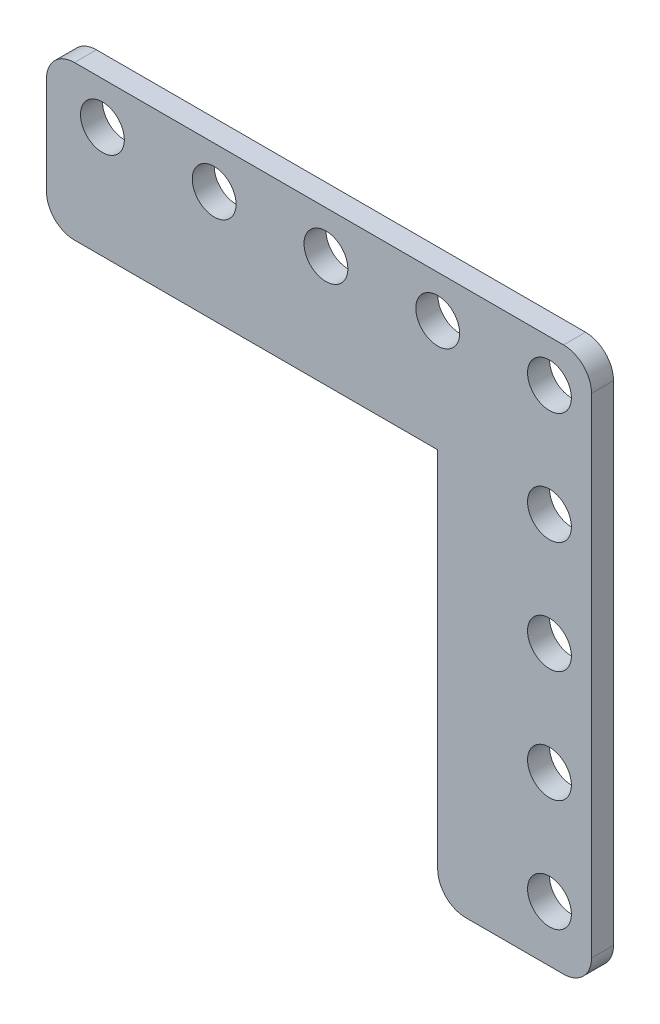
ISO-10303-21;
HEADER;
FILE_DESCRIPTION(('STEP AP214'),'2;1');
FILE_NAME('part.step','',(''),(''),'','','');
FILE_SCHEMA(('AUTOMOTIVE_DESIGN { 1 0 10303 214 1 1 1 1 }'));
ENDSEC;
DATA;
#1=APPLICATION_CONTEXT('core data for automotive mechanical design processes');
#2=APPLICATION_PROTOCOL_DEFINITION('international standard','automotive_design',2000,#1);
#3=PRODUCT_CONTEXT('',#1,'mechanical');
#4=PRODUCT('Part','Part','',(#3));
#5=PRODUCT_RELATED_PRODUCT_CATEGORY('part','',(#4));
#6=PRODUCT_DEFINITION_FORMATION('','',#4);
#7=PRODUCT_DEFINITION_CONTEXT('part definition',#1,'design');
#8=PRODUCT_DEFINITION('design','',#6,#7);
#9=PRODUCT_DEFINITION_SHAPE('','',#8);
#10=(LENGTH_UNIT() NAMED_UNIT(*) SI_UNIT(.MILLI.,.METRE.));
#11=(NAMED_UNIT(*) PLANE_ANGLE_UNIT() SI_UNIT($,.RADIAN.));
#12=(NAMED_UNIT(*) SI_UNIT($,.STERADIAN.) SOLID_ANGLE_UNIT());
#13=UNCERTAINTY_MEASURE_WITH_UNIT(LENGTH_MEASURE(1.E-05),#10,'distance_accuracy_value','');
#14=(GEOMETRIC_REPRESENTATION_CONTEXT(3) GLOBAL_UNCERTAINTY_ASSIGNED_CONTEXT((#13)) GLOBAL_UNIT_ASSIGNED_CONTEXT((#10,
#11,#12)) REPRESENTATION_CONTEXT('',''));
#15=CARTESIAN_POINT('',(0.,0.,0.));
#16=DIRECTION('',(0.,0.,1.));
#17=DIRECTION('',(1.,0.,0.));
#18=AXIS2_PLACEMENT_3D('',#15,#16,#17);
#19=CARTESIAN_POINT('',(-13.4873999999968,875.512599999967,2.50000000000015));
#20=DIRECTION('',(0.,0.,1.));
#21=DIRECTION('',(1.,0.,0.));
#22=AXIS2_PLACEMENT_3D('',#19,#20,#21);
#23=PLANE('',#22);
#24=CARTESIAN_POINT('',(-38.0999999999977,901.699999999967,2.50000000000015));
#25=DIRECTION('',(0.,0.,-1.));
#26=DIRECTION('',(1.,0.,0.));
#27=AXIS2_PLACEMENT_3D('',#24,#25,#26);
#28=CIRCLE('',#27,2.4892);
#29=CARTESIAN_POINT('',(-40.5891999999977,901.699999999967,2.50000000000015));
#30=VERTEX_POINT('',#29);
#31=EDGE_CURVE('E180',#30,#30,#28,.T.);
#32=ORIENTED_EDGE('',*,*,#31,.T.);
#33=EDGE_LOOP('',(#32));
#34=FACE_BOUND('',#33,.T.);
#35=CARTESIAN_POINT('',(12.7000000000032,901.699999999967,2.50000000000015));
#36=DIRECTION('',(0.,0.,-1.));
#37=DIRECTION('',(1.,0.,0.));
#38=AXIS2_PLACEMENT_3D('',#35,#36,#37);
#39=CIRCLE('',#38,2.4892);
#40=CARTESIAN_POINT('',(10.2108000000032,901.699999999967,2.50000000000015));
#41=VERTEX_POINT('',#40);
#42=EDGE_CURVE('E220',#41,#41,#39,.T.);
#43=ORIENTED_EDGE('',*,*,#42,.T.);
#44=EDGE_LOOP('',(#43));
#45=FACE_BOUND('',#44,.T.);
#46=CARTESIAN_POINT('',(12.700000000003,850.89999999997,2.50000000000015));
#47=DIRECTION('',(0.,0.,-1.));
#48=DIRECTION('',(1.,0.,0.));
#49=AXIS2_PLACEMENT_3D('',#46,#47,#48);
#50=CIRCLE('',#49,2.4892);
#51=CARTESIAN_POINT('',(10.210800000003,850.89999999997,2.50000000000015));
#52=VERTEX_POINT('',#51);
#53=EDGE_CURVE('E208',#52,#52,#50,.T.);
#54=ORIENTED_EDGE('',*,*,#53,.T.);
#55=EDGE_LOOP('',(#54));
#56=FACE_BOUND('',#55,.T.);
#57=CARTESIAN_POINT('',(12.7000000000032,888.999999999967,2.50000000000015));
#58=DIRECTION('',(0.,0.,-1.));
#59=DIRECTION('',(1.,0.,0.));
#60=AXIS2_PLACEMENT_3D('',#57,#58,#59);
#61=CIRCLE('',#60,2.4892);
#62=CARTESIAN_POINT('',(10.2108000000032,888.999999999967,2.50000000000015));
#63=VERTEX_POINT('',#62);
#64=EDGE_CURVE('E148',#63,#63,#61,.T.);
#65=ORIENTED_EDGE('',*,*,#64,.T.);
#66=EDGE_LOOP('',(#65));
#67=FACE_BOUND('',#66,.T.);
#68=CARTESIAN_POINT('',(-25.3999999999976,901.699999999967,2.50000000000015));
#69=DIRECTION('',(0.,0.,-1.));
#70=DIRECTION('',(1.,0.,0.));
#71=AXIS2_PLACEMENT_3D('',#68,#69,#70);
#72=CIRCLE('',#71,2.4892);
#73=CARTESIAN_POINT('',(-27.8891999999977,901.699999999967,2.50000000000015));
#74=VERTEX_POINT('',#73);
#75=EDGE_CURVE('E184',#74,#74,#72,.T.);
#76=ORIENTED_EDGE('',*,*,#75,.T.);
#77=EDGE_LOOP('',(#76));
#78=FACE_BOUND('',#77,.T.);
#79=CARTESIAN_POINT('',(3.29514193708748E-12,901.699999999967,2.50000000000015));
#80=DIRECTION('',(0.,0.,-1.));
#81=DIRECTION('',(1.,0.,0.));
#82=AXIS2_PLACEMENT_3D('',#79,#80,#81);
#83=CIRCLE('',#82,2.4892);
#84=CARTESIAN_POINT('',(-2.4891999999967,901.699999999967,2.50000000000015));
#85=VERTEX_POINT('',#84);
#86=EDGE_CURVE('E137',#85,#85,#83,.T.);
#87=ORIENTED_EDGE('',*,*,#86,.T.);
#88=EDGE_LOOP('',(#87));
#89=FACE_BOUND('',#88,.T.);
#90=CARTESIAN_POINT('',(12.7000000000031,863.59999999997,2.50000000000015));
#91=DIRECTION('',(0.,0.,-1.));
#92=DIRECTION('',(1.,0.,0.));
#93=AXIS2_PLACEMENT_3D('',#90,#91,#92);
#94=CIRCLE('',#93,2.4892);
#95=CARTESIAN_POINT('',(10.2108000000031,863.59999999997,2.50000000000015));
#96=VERTEX_POINT('',#95);
#97=EDGE_CURVE('E168',#96,#96,#94,.T.);
#98=ORIENTED_EDGE('',*,*,#97,.T.);
#99=EDGE_LOOP('',(#98));
#100=FACE_BOUND('',#99,.T.);
#101=CARTESIAN_POINT('',(12.7000000000031,876.299999999969,2.50000000000015));
#102=DIRECTION('',(0.,0.,-1.));
#103=DIRECTION('',(1.,0.,0.));
#104=AXIS2_PLACEMENT_3D('',#101,#102,#103);
#105=CIRCLE('',#104,2.4892);
#106=CARTESIAN_POINT('',(10.2108000000031,876.299999999969,2.50000000000015));
#107=VERTEX_POINT('',#106);
#108=EDGE_CURVE('E143',#107,#107,#105,.T.);
#109=ORIENTED_EDGE('',*,*,#108,.T.);
#110=EDGE_LOOP('',(#109));
#111=FACE_BOUND('',#110,.T.);
#112=CARTESIAN_POINT('',(-12.699999999997,901.699999999967,2.50000000000015));
#113=DIRECTION('',(0.,0.,-1.));
#114=DIRECTION('',(1.,0.,0.));
#115=AXIS2_PLACEMENT_3D('',#112,#113,#114);
#116=CIRCLE('',#115,2.4892);
#117=CARTESIAN_POINT('',(-15.189199999997,901.699999999967,2.50000000000015));
#118=VERTEX_POINT('',#117);
#119=EDGE_CURVE('E133',#118,#118,#116,.T.);
#120=ORIENTED_EDGE('',*,*,#119,.T.);
#121=EDGE_LOOP('',(#120));
#122=FACE_BOUND('',#121,.T.);
#123=CARTESIAN_POINT('',(14.3002000000032,847.724999999967,2.50000000000015));
#124=DIRECTION('',(0.,0.,-1.));
#125=DIRECTION('',(0.707106781186552,-0.707106781186543,0.));
#126=AXIS2_PLACEMENT_3D('',#123,#124,#125);
#127=CIRCLE('',#126,3.175);
#128=CARTESIAN_POINT('',(17.4752000000032,847.724999999967,2.50000000000015));
#129=VERTEX_POINT('',#128);
#130=CARTESIAN_POINT('',(14.3002000000032,844.549999999967,2.50000000000015));
#131=VERTEX_POINT('',#130);
#132=EDGE_CURVE('E232',#129,#131,#127,.T.);
#133=ORIENTED_EDGE('',*,*,#132,.F.);
#134=DIRECTION('',(0.,1.,0.));
#135=VECTOR('',#134,1.);
#136=CARTESIAN_POINT('',(17.4752000000032,844.549999999967,2.50000000000015));
#137=LINE('',#136,#135);
#138=CARTESIAN_POINT('',(17.4752000000032,903.300199999967,2.50000000000015));
#139=VERTEX_POINT('',#138);
#140=EDGE_CURVE('E84',#129,#139,#137,.T.);
#141=ORIENTED_EDGE('',*,*,#140,.T.);
#142=CARTESIAN_POINT('',(14.3002000000032,903.300199999967,2.50000000000015));
#143=DIRECTION('',(0.,0.,-1.));
#144=DIRECTION('',(0.707106781186552,0.707106781186543,0.));
#145=AXIS2_PLACEMENT_3D('',#142,#143,#144);
#146=CIRCLE('',#145,3.175);
#147=CARTESIAN_POINT('',(14.3002000000032,906.475199999967,2.50000000000015));
#148=VERTEX_POINT('',#147);
#149=EDGE_CURVE('E90',#148,#139,#146,.T.);
#150=ORIENTED_EDGE('',*,*,#149,.F.);
#151=DIRECTION('',(-1.,0.,0.));
#152=VECTOR('',#151,1.);
#153=CARTESIAN_POINT('',(17.4752000000032,906.475199999967,2.50000000000015));
#154=LINE('',#153,#152);
#155=CARTESIAN_POINT('',(-41.2749999999967,906.475199999967,2.50000000000015));
#156=VERTEX_POINT('',#155);
#157=EDGE_CURVE('E71',#148,#156,#154,.T.);
#158=ORIENTED_EDGE('',*,*,#157,.T.);
#159=CARTESIAN_POINT('',(-41.2749999999967,903.300199999967,2.50000000000015));
#160=DIRECTION('',(0.,0.,-1.));
#161=DIRECTION('',(-0.707106781186552,0.707106781186543,0.));
#162=AXIS2_PLACEMENT_3D('',#159,#160,#161);
#163=CIRCLE('',#162,3.175);
#164=CARTESIAN_POINT('',(-44.4499999999967,903.300199999967,2.50000000000015));
#165=VERTEX_POINT('',#164);
#166=EDGE_CURVE('E107',#165,#156,#163,.T.);
#167=ORIENTED_EDGE('',*,*,#166,.F.);
#168=DIRECTION('',(0.,-1.,0.));
#169=VECTOR('',#168,1.);
#170=CARTESIAN_POINT('',(-44.4499999999967,906.475199999967,2.50000000000015));
#171=LINE('',#170,#169);
#172=CARTESIAN_POINT('',(-44.4499999999967,892.174999999967,2.50000000000015));
#173=VERTEX_POINT('',#172);
#174=EDGE_CURVE('E305',#165,#173,#171,.T.);
#175=ORIENTED_EDGE('',*,*,#174,.T.);
#176=CARTESIAN_POINT('',(-41.2749999999967,892.174999999967,2.50000000000015));
#177=DIRECTION('',(0.,0.,-1.));
#178=DIRECTION('',(-0.707106781186552,-0.707106781186543,0.));
#179=AXIS2_PLACEMENT_3D('',#176,#177,#178);
#180=CIRCLE('',#179,3.175);
#181=CARTESIAN_POINT('',(-41.2749999999967,888.999999999967,2.50000000000015));
#182=VERTEX_POINT('',#181);
#183=EDGE_CURVE('E243',#182,#173,#180,.T.);
#184=ORIENTED_EDGE('',*,*,#183,.F.);
#185=DIRECTION('',(1.,0.,0.));
#186=VECTOR('',#185,1.);
#187=CARTESIAN_POINT('',(-44.4499999999967,888.999999999967,2.50000000000015));
#188=LINE('',#187,#186);
#189=CARTESIAN_POINT('',(3.22408766351145E-12,888.999999999967,2.50000000000015));
#190=VERTEX_POINT('',#189);
#191=EDGE_CURVE('E11',#182,#190,#188,.T.);
#192=ORIENTED_EDGE('',*,*,#191,.T.);
#193=DIRECTION('',(0.,-1.,0.));
#194=VECTOR('',#193,1.);
#195=CARTESIAN_POINT('',(3.22408766351145E-12,888.999999999967,2.50000000000015));
#196=LINE('',#195,#194);
#197=CARTESIAN_POINT('',(3.10656262619042E-12,847.724999999967,2.50000000000015));
#198=VERTEX_POINT('',#197);
#199=EDGE_CURVE('E83',#190,#198,#196,.T.);
#200=ORIENTED_EDGE('',*,*,#199,.T.);
#201=CARTESIAN_POINT('',(3.1750000000031,847.724999999967,2.50000000000015));
#202=DIRECTION('',(0.,0.,-1.));
#203=DIRECTION('',(-0.707106781186553,-0.707106781186542,0.));
#204=AXIS2_PLACEMENT_3D('',#201,#202,#203);
#205=CIRCLE('',#204,3.175);
#206=CARTESIAN_POINT('',(3.1750000000031,844.549999999967,2.50000000000015));
#207=VERTEX_POINT('',#206);
#208=EDGE_CURVE('E188',#207,#198,#205,.T.);
#209=ORIENTED_EDGE('',*,*,#208,.F.);
#210=DIRECTION('',(1.,0.,0.));
#211=VECTOR('',#210,1.);
#212=CARTESIAN_POINT('',(3.0975222387042E-12,844.549999999967,2.50000000000015));
#213=LINE('',#212,#211);
#214=EDGE_CURVE('E289',#207,#131,#213,.T.);
#215=ORIENTED_EDGE('',*,*,#214,.T.);
#216=EDGE_LOOP('',(#133,#141,#150,#158,#167,#175,#184,#192,#200,#209,#215));
#217=FACE_BOUND('',#216,.T.);
#218=ADVANCED_FACE('F17',(#34,#45,#56,#67,#78,#89,#100,#111,#122,#217),#23,.T.);
#219=CARTESIAN_POINT('',(-44.4499999999967,888.999999999967,1.53287466406063E-13));
#220=DIRECTION('',(0.,-1.,0.));
#221=DIRECTION('',(-1.,0.,0.));
#222=AXIS2_PLACEMENT_3D('',#219,#220,#221);
#223=PLANE('',#222);
#224=DIRECTION('',(0.,0.,1.));
#225=VECTOR('',#224,1.);
#226=CARTESIAN_POINT('',(-41.2749999999967,888.999999999967,1.53397238558369E-13));
#227=LINE('',#226,#225);
#228=CARTESIAN_POINT('',(-41.2749999999967,888.999999999967,1.5328673490841E-13));
#229=VERTEX_POINT('',#228);
#230=EDGE_CURVE('E302',#229,#182,#227,.T.);
#231=ORIENTED_EDGE('',*,*,#230,.F.);
#232=DIRECTION('',(1.,0.,0.));
#233=VECTOR('',#232,1.);
#234=CARTESIAN_POINT('',(-44.4499999999967,888.999999999967,1.53287466406063E-13));
#235=LINE('',#234,#233);
#236=CARTESIAN_POINT('',(3.22408766351145E-12,888.999999999967,1.53277225438917E-13));
#237=VERTEX_POINT('',#236);
#238=EDGE_CURVE('E265',#229,#237,#235,.T.);
#239=ORIENTED_EDGE('',*,*,#238,.T.);
#240=DIRECTION('',(0.,0.,1.));
#241=VECTOR('',#240,1.);
#242=CARTESIAN_POINT('',(3.22408766351145E-12,888.999999999967,1.53277225438917E-13));
#243=LINE('',#242,#241);
#244=EDGE_CURVE('E26',#237,#190,#243,.T.);
#245=ORIENTED_EDGE('',*,*,#244,.T.);
#246=ORIENTED_EDGE('',*,*,#191,.F.);
#247=EDGE_LOOP('',(#231,#239,#245,#246));
#248=FACE_BOUND('',#247,.T.);
#249=ADVANCED_FACE('F415',(#248),#223,.T.);
#250=CARTESIAN_POINT('',(3.22408766351145E-12,888.999999999967,1.53277225438917E-13));
#251=DIRECTION('',(-1.,0.,0.));
#252=DIRECTION('',(0.,0.,1.));
#253=AXIS2_PLACEMENT_3D('',#250,#251,#252);
#254=PLANE('',#253);
#255=DIRECTION('',(0.,0.,-1.));
#256=VECTOR('',#255,1.);
#257=CARTESIAN_POINT('',(3.1064040229012E-12,847.724999999967,1.52998008481745E-13));
#258=LINE('',#257,#256);
#259=CARTESIAN_POINT('',(3.10656262619042E-12,847.724999999967,1.52758679661312E-13));
#260=VERTEX_POINT('',#259);
#261=EDGE_CURVE('E192',#198,#260,#258,.T.);
#262=ORIENTED_EDGE('',*,*,#261,.F.);
#263=ORIENTED_EDGE('',*,*,#199,.F.);
#264=ORIENTED_EDGE('',*,*,#244,.F.);
#265=DIRECTION('',(0.,-1.,0.));
#266=VECTOR('',#265,1.);
#267=CARTESIAN_POINT('',(3.22408766351145E-12,888.999999999967,1.53277225438917E-13));
#268=LINE('',#267,#266);
#269=EDGE_CURVE('E163',#237,#260,#268,.T.);
#270=ORIENTED_EDGE('',*,*,#269,.T.);
#271=EDGE_LOOP('',(#262,#263,#264,#270));
#272=FACE_BOUND('',#271,.T.);
#273=ADVANCED_FACE('F421',(#272),#254,.T.);
#274=CARTESIAN_POINT('',(17.4752000000032,906.475199999967,1.53492743580445E-13));
#275=DIRECTION('',(0.,1.,0.));
#276=DIRECTION('',(1.,0.,0.));
#277=AXIS2_PLACEMENT_3D('',#274,#275,#276);
#278=PLANE('',#277);
#279=DIRECTION('',(0.,0.,-1.));
#280=VECTOR('',#279,1.);
#281=CARTESIAN_POINT('',(-41.2749999999967,906.475199999967,1.5349987714556E-13));
#282=LINE('',#281,#280);
#283=CARTESIAN_POINT('',(-41.2749999999967,906.475199999967,1.53506279213021E-13));
#284=VERTEX_POINT('',#283);
#285=EDGE_CURVE('E79',#156,#284,#282,.T.);
#286=ORIENTED_EDGE('',*,*,#285,.F.);
#287=ORIENTED_EDGE('',*,*,#157,.F.);
#288=DIRECTION('',(0.,0.,1.));
#289=VECTOR('',#288,1.);
#290=CARTESIAN_POINT('',(14.3002000000032,906.475199999967,1.53103754470967E-13));
#291=LINE('',#290,#289);
#292=CARTESIAN_POINT('',(14.3002000000032,906.475199999967,1.53493475078099E-13));
#293=VERTEX_POINT('',#292);
#294=EDGE_CURVE('E76',#293,#148,#291,.T.);
#295=ORIENTED_EDGE('',*,*,#294,.F.);
#296=DIRECTION('',(-1.,0.,0.));
#297=VECTOR('',#296,1.);
#298=CARTESIAN_POINT('',(17.4752000000032,906.475199999967,1.53492743580445E-13));
#299=LINE('',#298,#297);
#300=EDGE_CURVE('E280',#293,#284,#299,.T.);
#301=ORIENTED_EDGE('',*,*,#300,.T.);
#302=EDGE_LOOP('',(#286,#287,#295,#301));
#303=FACE_BOUND('',#302,.T.);
#304=ADVANCED_FACE('F73',(#303),#278,.T.);
#305=CARTESIAN_POINT('',(17.4752000000032,844.549999999967,1.52714765361489E-13));
#306=DIRECTION('',(1.,0.,0.));
#307=DIRECTION('',(0.,1.,0.));
#308=AXIS2_PLACEMENT_3D('',#305,#306,#307);
#309=PLANE('',#308);
#310=DIRECTION('',(0.,0.,1.));
#311=VECTOR('',#310,1.);
#312=CARTESIAN_POINT('',(17.4752000000032,847.724999999967,1.52716778443031E-13));
#313=LINE('',#312,#311);
#314=CARTESIAN_POINT('',(17.4752000000032,847.724999999967,1.52754653498228E-13));
#315=VERTEX_POINT('',#314);
#316=EDGE_CURVE('E255',#315,#129,#313,.T.);
#317=ORIENTED_EDGE('',*,*,#316,.F.);
#318=DIRECTION('',(0.,1.,0.));
#319=VECTOR('',#318,1.);
#320=CARTESIAN_POINT('',(17.4752000000032,844.549999999967,1.52714765361489E-13));
#321=LINE('',#320,#319);
#322=CARTESIAN_POINT('',(17.4752000000032,903.300199999967,1.53452855443706E-13));
#323=VERTEX_POINT('',#322);
#324=EDGE_CURVE('E285',#315,#323,#321,.T.);
#325=ORIENTED_EDGE('',*,*,#324,.T.);
#326=DIRECTION('',(0.,0.,-1.));
#327=VECTOR('',#326,1.);
#328=CARTESIAN_POINT('',(17.4752000000032,903.300199999967,1.53103754470967E-13));
#329=LINE('',#328,#327);
#330=EDGE_CURVE('E95',#139,#323,#329,.T.);
#331=ORIENTED_EDGE('',*,*,#330,.F.);
#332=ORIENTED_EDGE('',*,*,#140,.F.);
#333=EDGE_LOOP('',(#317,#325,#331,#332));
#334=FACE_BOUND('',#333,.T.);
#335=ADVANCED_FACE('F394',(#334),#309,.T.);
#336=CARTESIAN_POINT('',(14.3002000000032,903.300199999967,1.53103754470967E-13));
#337=DIRECTION('',(0.,0.,1.));
#338=DIRECTION('',(0.707106781186552,0.707106781186543,0.));
#339=AXIS2_PLACEMENT_3D('',#336,#337,#338);
#340=CYLINDRICAL_SURFACE('',#339,3.175);
#341=ORIENTED_EDGE('',*,*,#149,.T.);
#342=ORIENTED_EDGE('',*,*,#330,.T.);
#343=CARTESIAN_POINT('',(14.3002000000032,903.300199999967,1.53110888036082E-13));
#344=DIRECTION('',(0.,0.,1.));
#345=DIRECTION('',(0.707106781186552,0.707106781186543,0.));
#346=AXIS2_PLACEMENT_3D('',#343,#344,#345);
#347=CIRCLE('',#346,3.175);
#348=EDGE_CURVE('E92',#323,#293,#347,.T.);
#349=ORIENTED_EDGE('',*,*,#348,.T.);
#350=ORIENTED_EDGE('',*,*,#294,.T.);
#351=EDGE_LOOP('',(#341,#342,#349,#350));
#352=FACE_BOUND('',#351,.T.);
#353=ADVANCED_FACE('F88',(#352),#340,.T.);
#354=CARTESIAN_POINT('',(-41.2749999999967,903.300199999967,1.5349987714556E-13));
#355=DIRECTION('',(0.,0.,1.));
#356=DIRECTION('',(-0.707106781186552,0.707106781186543,0.));
#357=AXIS2_PLACEMENT_3D('',#354,#355,#356);
#358=CYLINDRICAL_SURFACE('',#357,3.175);
#359=ORIENTED_EDGE('',*,*,#166,.T.);
#360=ORIENTED_EDGE('',*,*,#285,.T.);
#361=CARTESIAN_POINT('',(-41.2749999999967,903.300199999967,1.53110888036082E-13));
#362=DIRECTION('',(0.,0.,1.));
#363=DIRECTION('',(-0.707106781186552,0.707106781186543,0.));
#364=AXIS2_PLACEMENT_3D('',#361,#362,#363);
#365=CIRCLE('',#364,3.175);
#366=CARTESIAN_POINT('',(-44.4499999999967,903.300199999967,1.53467122573935E-13));
#367=VERTEX_POINT('',#366);
#368=EDGE_CURVE('E276',#284,#367,#365,.T.);
#369=ORIENTED_EDGE('',*,*,#368,.T.);
#370=DIRECTION('',(0.,0.,1.));
#371=VECTOR('',#370,1.);
#372=CARTESIAN_POINT('',(-44.4499999999967,903.300199999967,1.5349987714556E-13));
#373=LINE('',#372,#371);
#374=EDGE_CURVE('E306',#367,#165,#373,.T.);
#375=ORIENTED_EDGE('',*,*,#374,.T.);
#376=EDGE_LOOP('',(#359,#360,#369,#375));
#377=FACE_BOUND('',#376,.T.);
#378=ADVANCED_FACE('F398',(#377),#358,.T.);
#379=CARTESIAN_POINT('',(-44.4499999999967,906.475199999967,1.53507010710674E-13));
#380=DIRECTION('',(-1.,0.,0.));
#381=DIRECTION('',(0.,0.,1.));
#382=AXIS2_PLACEMENT_3D('',#379,#380,#381);
#383=PLANE('',#382);
#384=DIRECTION('',(0.,0.,-1.));
#385=VECTOR('',#384,1.);
#386=CARTESIAN_POINT('',(-44.4499999999967,892.174999999967,1.53397238558369E-13));
#387=LINE('',#386,#385);
#388=CARTESIAN_POINT('',(-44.4499999999967,892.174999999967,1.53327354542802E-13));
#389=VERTEX_POINT('',#388);
#390=EDGE_CURVE('E247',#173,#389,#387,.T.);
#391=ORIENTED_EDGE('',*,*,#390,.F.);
#392=ORIENTED_EDGE('',*,*,#174,.F.);
#393=ORIENTED_EDGE('',*,*,#374,.F.);
#394=DIRECTION('',(0.,-1.,0.));
#395=VECTOR('',#394,1.);
#396=CARTESIAN_POINT('',(-44.4499999999967,906.475199999967,1.53507010710674E-13));
#397=LINE('',#396,#395);
#398=EDGE_CURVE('E272',#367,#389,#397,.T.);
#399=ORIENTED_EDGE('',*,*,#398,.T.);
#400=EDGE_LOOP('',(#391,#392,#393,#399));
#401=FACE_BOUND('',#400,.T.);
#402=ADVANCED_FACE('F400',(#401),#383,.T.);
#403=CARTESIAN_POINT('',(-41.2749999999967,892.174999999967,1.53397238558369E-13));
#404=DIRECTION('',(0.,0.,1.));
#405=DIRECTION('',(-0.707106781186552,-0.707106781186543,0.));
#406=AXIS2_PLACEMENT_3D('',#403,#404,#405);
#407=CYLINDRICAL_SURFACE('',#406,3.175);
#408=ORIENTED_EDGE('',*,*,#183,.T.);
#409=ORIENTED_EDGE('',*,*,#390,.T.);
#410=CARTESIAN_POINT('',(-41.2749999999967,892.174999999967,1.53110888036082E-13));
#411=DIRECTION('',(0.,0.,1.));
#412=DIRECTION('',(-0.707106781186552,-0.707106781186543,0.));
#413=AXIS2_PLACEMENT_3D('',#410,#411,#412);
#414=CIRCLE('',#413,3.175);
#415=EDGE_CURVE('E268',#389,#229,#414,.T.);
#416=ORIENTED_EDGE('',*,*,#415,.T.);
#417=ORIENTED_EDGE('',*,*,#230,.T.);
#418=EDGE_LOOP('',(#408,#409,#416,#417));
#419=FACE_BOUND('',#418,.T.);
#420=ADVANCED_FACE('F408',(#419),#407,.T.);
#421=CARTESIAN_POINT('',(3.1750000000031,847.724999999967,1.52998008481745E-13));
#422=DIRECTION('',(0.,0.,1.));
#423=DIRECTION('',(-0.707106781186553,-0.707106781186542,0.));
#424=AXIS2_PLACEMENT_3D('',#421,#422,#423);
#425=CYLINDRICAL_SURFACE('',#424,3.175);
#426=ORIENTED_EDGE('',*,*,#208,.T.);
#427=ORIENTED_EDGE('',*,*,#261,.T.);
#428=CARTESIAN_POINT('',(3.1750000000031,847.724999999967,1.53110888036082E-13));
#429=DIRECTION('',(0.,0.,1.));
#430=DIRECTION('',(-0.707106781186553,-0.707106781186542,0.));
#431=AXIS2_PLACEMENT_3D('',#428,#429,#430);
#432=CIRCLE('',#431,3.175);
#433=CARTESIAN_POINT('',(3.1750000000031,844.549999999967,1.52718060026919E-13));
#434=VERTEX_POINT('',#433);
#435=EDGE_CURVE('E159',#260,#434,#432,.T.);
#436=ORIENTED_EDGE('',*,*,#435,.T.);
#437=DIRECTION('',(0.,0.,1.));
#438=VECTOR('',#437,1.);
#439=CARTESIAN_POINT('',(3.1750000000031,844.549999999967,1.52998008481745E-13));
#440=LINE('',#439,#438);
#441=EDGE_CURVE('E193',#434,#207,#440,.T.);
#442=ORIENTED_EDGE('',*,*,#441,.T.);
#443=EDGE_LOOP('',(#426,#427,#436,#442));
#444=FACE_BOUND('',#443,.T.);
#445=ADVANCED_FACE('F518',(#444),#425,.T.);
#446=CARTESIAN_POINT('',(3.0975222387042E-12,844.549999999967,1.52718791524573E-13));
#447=DIRECTION('',(0.,-1.,0.));
#448=DIRECTION('',(0.,0.,-1.));
#449=AXIS2_PLACEMENT_3D('',#446,#447,#448);
#450=PLANE('',#449);
#451=DIRECTION('',(0.,0.,-1.));
#452=VECTOR('',#451,1.);
#453=CARTESIAN_POINT('',(14.3002000000032,844.549999999967,1.52716778443031E-13));
#454=LINE('',#453,#452);
#455=CARTESIAN_POINT('',(14.3002000000032,844.549999999967,1.52715496859142E-13));
#456=VERTEX_POINT('',#455);
#457=EDGE_CURVE('E242',#131,#456,#454,.T.);
#458=ORIENTED_EDGE('',*,*,#457,.F.);
#459=ORIENTED_EDGE('',*,*,#214,.F.);
#460=ORIENTED_EDGE('',*,*,#441,.F.);
#461=DIRECTION('',(1.,0.,0.));
#462=VECTOR('',#461,1.);
#463=CARTESIAN_POINT('',(3.0975222387042E-12,844.549999999967,1.52718791524573E-13));
#464=LINE('',#463,#462);
#465=EDGE_CURVE('E164',#434,#456,#464,.T.);
#466=ORIENTED_EDGE('',*,*,#465,.T.);
#467=EDGE_LOOP('',(#458,#459,#460,#466));
#468=FACE_BOUND('',#467,.T.);
#469=ADVANCED_FACE('F340',(#468),#450,.T.);
#470=CARTESIAN_POINT('',(-13.4873999999968,875.512599999967,1.53110888036082E-13));
#471=DIRECTION('',(0.,0.,1.));
#472=DIRECTION('',(0.,-1.,0.));
#473=AXIS2_PLACEMENT_3D('',#470,#471,#472);
#474=PLANE('',#473);
#475=CARTESIAN_POINT('',(-38.0999999999977,901.699999999967,1.53210777398272E-13));
#476=DIRECTION('',(0.,0.,1.));
#477=DIRECTION('',(1.,0.,0.));
#478=AXIS2_PLACEMENT_3D('',#475,#476,#477);
#479=CIRCLE('',#478,2.4892);
#480=CARTESIAN_POINT('',(-40.5891999999977,901.699999999967,1.53210777398272E-13));
#481=VERTEX_POINT('',#480);
#482=EDGE_CURVE('E179',#481,#481,#479,.T.);
#483=ORIENTED_EDGE('',*,*,#482,.T.);
#484=EDGE_LOOP('',(#483));
#485=FACE_BOUND('',#484,.T.);
#486=CARTESIAN_POINT('',(12.7000000000032,901.699999999967,1.53210777398272E-13));
#487=DIRECTION('',(0.,0.,1.));
#488=DIRECTION('',(1.,0.,0.));
#489=AXIS2_PLACEMENT_3D('',#486,#487,#488);
#490=CIRCLE('',#489,2.4892);
#491=CARTESIAN_POINT('',(10.2108000000032,901.699999999967,1.53210777398272E-13));
#492=VERTEX_POINT('',#491);
#493=EDGE_CURVE('E228',#492,#492,#490,.T.);
#494=ORIENTED_EDGE('',*,*,#493,.T.);
#495=EDGE_LOOP('',(#494));
#496=FACE_BOUND('',#495,.T.);
#497=CARTESIAN_POINT('',(12.700000000003,850.89999999997,1.53210777398272E-13));
#498=DIRECTION('',(0.,0.,1.));
#499=DIRECTION('',(1.,0.,0.));
#500=AXIS2_PLACEMENT_3D('',#497,#498,#499);
#501=CIRCLE('',#500,2.4892);
#502=CARTESIAN_POINT('',(10.210800000003,850.89999999997,1.53210777398272E-13));
#503=VERTEX_POINT('',#502);
#504=EDGE_CURVE('E216',#503,#503,#501,.T.);
#505=ORIENTED_EDGE('',*,*,#504,.T.);
#506=EDGE_LOOP('',(#505));
#507=FACE_BOUND('',#506,.T.);
#508=CARTESIAN_POINT('',(12.7000000000032,888.999999999967,1.53210777398272E-13));
#509=DIRECTION('',(0.,0.,1.));
#510=DIRECTION('',(1.,0.,0.));
#511=AXIS2_PLACEMENT_3D('',#508,#509,#510);
#512=CIRCLE('',#511,2.4892);
#513=CARTESIAN_POINT('',(10.2108000000032,888.999999999967,1.53210777398272E-13));
#514=VERTEX_POINT('',#513);
#515=EDGE_CURVE('E204',#514,#514,#512,.T.);
#516=ORIENTED_EDGE('',*,*,#515,.T.);
#517=EDGE_LOOP('',(#516));
#518=FACE_BOUND('',#517,.T.);
#519=CARTESIAN_POINT('',(-25.3999999999976,901.699999999967,1.53210777398272E-13));
#520=DIRECTION('',(0.,0.,1.));
#521=DIRECTION('',(1.,0.,0.));
#522=AXIS2_PLACEMENT_3D('',#519,#520,#521);
#523=CIRCLE('',#522,2.4892);
#524=CARTESIAN_POINT('',(-27.8891999999977,901.699999999967,1.53210777398272E-13));
#525=VERTEX_POINT('',#524);
#526=EDGE_CURVE('E144',#525,#525,#523,.T.);
#527=ORIENTED_EDGE('',*,*,#526,.T.);
#528=EDGE_LOOP('',(#527));
#529=FACE_BOUND('',#528,.T.);
#530=CARTESIAN_POINT('',(3.29514193708748E-12,901.699999999967,1.53210777398272E-13));
#531=DIRECTION('',(0.,0.,1.));
#532=DIRECTION('',(1.,0.,0.));
#533=AXIS2_PLACEMENT_3D('',#530,#531,#532);
#534=CIRCLE('',#533,2.4892);
#535=CARTESIAN_POINT('',(-2.4891999999967,901.699999999967,1.53210777398272E-13));
#536=VERTEX_POINT('',#535);
#537=EDGE_CURVE('E127',#536,#536,#534,.T.);
#538=ORIENTED_EDGE('',*,*,#537,.T.);
#539=EDGE_LOOP('',(#538));
#540=FACE_BOUND('',#539,.T.);
#541=CARTESIAN_POINT('',(12.7000000000031,863.59999999997,1.53210777398272E-13));
#542=DIRECTION('',(0.,0.,1.));
#543=DIRECTION('',(1.,0.,0.));
#544=AXIS2_PLACEMENT_3D('',#541,#542,#543);
#545=CIRCLE('',#544,2.4892);
#546=CARTESIAN_POINT('',(10.2108000000031,863.59999999997,1.53210777398272E-13));
#547=VERTEX_POINT('',#546);
#548=EDGE_CURVE('E134',#547,#547,#545,.T.);
#549=ORIENTED_EDGE('',*,*,#548,.T.);
#550=EDGE_LOOP('',(#549));
#551=FACE_BOUND('',#550,.T.);
#552=CARTESIAN_POINT('',(12.7000000000031,876.299999999969,1.53210777398272E-13));
#553=DIRECTION('',(0.,0.,1.));
#554=DIRECTION('',(1.,0.,0.));
#555=AXIS2_PLACEMENT_3D('',#552,#553,#554);
#556=CIRCLE('',#555,2.4892);
#557=CARTESIAN_POINT('',(10.2108000000031,876.299999999969,1.53210777398272E-13));
#558=VERTEX_POINT('',#557);
#559=EDGE_CURVE('E154',#558,#558,#556,.T.);
#560=ORIENTED_EDGE('',*,*,#559,.T.);
#561=EDGE_LOOP('',(#560));
#562=FACE_BOUND('',#561,.T.);
#563=CARTESIAN_POINT('',(-12.699999999997,901.699999999967,1.53210777398272E-13));
#564=DIRECTION('',(0.,0.,1.));
#565=DIRECTION('',(1.,0.,0.));
#566=AXIS2_PLACEMENT_3D('',#563,#564,#565);
#567=CIRCLE('',#566,2.4892);
#568=CARTESIAN_POINT('',(-15.189199999997,901.699999999967,1.53210777398272E-13));
#569=VERTEX_POINT('',#568);
#570=EDGE_CURVE('E132',#569,#569,#567,.T.);
#571=ORIENTED_EDGE('',*,*,#570,.T.);
#572=EDGE_LOOP('',(#571));
#573=FACE_BOUND('',#572,.T.);
#574=CARTESIAN_POINT('',(14.3002000000032,847.724999999967,1.53110888036082E-13));
#575=DIRECTION('',(0.,0.,1.));
#576=DIRECTION('',(0.707106781186552,-0.707106781186543,0.));
#577=AXIS2_PLACEMENT_3D('',#574,#575,#576);
#578=CIRCLE('',#577,3.175);
#579=EDGE_CURVE('E251',#456,#315,#578,.T.);
#580=ORIENTED_EDGE('',*,*,#579,.F.);
#581=ORIENTED_EDGE('',*,*,#465,.F.);
#582=ORIENTED_EDGE('',*,*,#435,.F.);
#583=ORIENTED_EDGE('',*,*,#269,.F.);
#584=ORIENTED_EDGE('',*,*,#238,.F.);
#585=ORIENTED_EDGE('',*,*,#415,.F.);
#586=ORIENTED_EDGE('',*,*,#398,.F.);
#587=ORIENTED_EDGE('',*,*,#368,.F.);
#588=ORIENTED_EDGE('',*,*,#300,.F.);
#589=ORIENTED_EDGE('',*,*,#348,.F.);
#590=ORIENTED_EDGE('',*,*,#324,.F.);
#591=EDGE_LOOP('',(#580,#581,#582,#583,#584,#585,#586,#587,#588,#589,#590));
#592=FACE_BOUND('',#591,.T.);
#593=ADVANCED_FACE('F336',(#485,#496,#507,#518,#529,#540,#551,#562,#573,#592),#474,.F.);
#594=CARTESIAN_POINT('',(14.3002000000032,847.724999999967,1.52716778443031E-13));
#595=DIRECTION('',(0.,0.,1.));
#596=DIRECTION('',(0.707106781186552,-0.707106781186543,0.));
#597=AXIS2_PLACEMENT_3D('',#594,#595,#596);
#598=CYLINDRICAL_SURFACE('',#597,3.175);
#599=ORIENTED_EDGE('',*,*,#132,.T.);
#600=ORIENTED_EDGE('',*,*,#457,.T.);
#601=ORIENTED_EDGE('',*,*,#579,.T.);
#602=ORIENTED_EDGE('',*,*,#316,.T.);
#603=EDGE_LOOP('',(#599,#600,#601,#602));
#604=FACE_BOUND('',#603,.T.);
#605=ADVANCED_FACE('F339',(#604),#598,.T.);
#606=CARTESIAN_POINT('',(-38.0999999999977,901.699999999967,2.50000000000015));
#607=DIRECTION('',(0.,0.,-1.));
#608=DIRECTION('',(1.,0.,0.));
#609=AXIS2_PLACEMENT_3D('',#606,#607,#608);
#610=CYLINDRICAL_SURFACE('',#609,2.4892);
#611=ORIENTED_EDGE('',*,*,#31,.F.);
#612=DIRECTION('',(0.,0.,-1.));
#613=VECTOR('',#612,1.);
#614=CARTESIAN_POINT('',(-40.5891999999977,901.699999999967,2.50000000000015));
#615=LINE('',#614,#613);
#616=EDGE_CURVE('E175',#30,#481,#615,.T.);
#617=ORIENTED_EDGE('',*,*,#616,.T.);
#618=ORIENTED_EDGE('',*,*,#482,.F.);
#619=ORIENTED_EDGE('',*,*,#616,.F.);
#620=EDGE_LOOP('',(#611,#617,#618,#619));
#621=FACE_BOUND('',#620,.T.);
#622=ADVANCED_FACE('F503',(#621),#610,.F.);
#623=CARTESIAN_POINT('',(12.7000000000032,901.699999999967,2.50000000000015));
#624=DIRECTION('',(0.,0.,-1.));
#625=DIRECTION('',(1.,0.,0.));
#626=AXIS2_PLACEMENT_3D('',#623,#624,#625);
#627=CYLINDRICAL_SURFACE('',#626,2.4892);
#628=ORIENTED_EDGE('',*,*,#42,.F.);
#629=DIRECTION('',(0.,0.,-1.));
#630=VECTOR('',#629,1.);
#631=CARTESIAN_POINT('',(10.2108000000032,901.699999999967,2.50000000000015));
#632=LINE('',#631,#630);
#633=EDGE_CURVE('E224',#41,#492,#632,.T.);
#634=ORIENTED_EDGE('',*,*,#633,.T.);
#635=ORIENTED_EDGE('',*,*,#493,.F.);
#636=ORIENTED_EDGE('',*,*,#633,.F.);
#637=EDGE_LOOP('',(#628,#634,#635,#636));
#638=FACE_BOUND('',#637,.T.);
#639=ADVANCED_FACE('F505',(#638),#627,.F.);
#640=CARTESIAN_POINT('',(12.700000000003,850.89999999997,2.50000000000015));
#641=DIRECTION('',(0.,0.,-1.));
#642=DIRECTION('',(1.,0.,0.));
#643=AXIS2_PLACEMENT_3D('',#640,#641,#642);
#644=CYLINDRICAL_SURFACE('',#643,2.4892);
#645=ORIENTED_EDGE('',*,*,#53,.F.);
#646=DIRECTION('',(0.,0.,-1.));
#647=VECTOR('',#646,1.);
#648=CARTESIAN_POINT('',(10.210800000003,850.89999999997,2.50000000000015));
#649=LINE('',#648,#647);
#650=EDGE_CURVE('E212',#52,#503,#649,.T.);
#651=ORIENTED_EDGE('',*,*,#650,.T.);
#652=ORIENTED_EDGE('',*,*,#504,.F.);
#653=ORIENTED_EDGE('',*,*,#650,.F.);
#654=EDGE_LOOP('',(#645,#651,#652,#653));
#655=FACE_BOUND('',#654,.T.);
#656=ADVANCED_FACE('F512',(#655),#644,.F.);
#657=CARTESIAN_POINT('',(12.7000000000032,888.999999999967,2.50000000000015));
#658=DIRECTION('',(0.,0.,-1.));
#659=DIRECTION('',(1.,0.,0.));
#660=AXIS2_PLACEMENT_3D('',#657,#658,#659);
#661=CYLINDRICAL_SURFACE('',#660,2.4892);
#662=ORIENTED_EDGE('',*,*,#64,.F.);
#663=DIRECTION('',(0.,0.,-1.));
#664=VECTOR('',#663,1.);
#665=CARTESIAN_POINT('',(10.2108000000032,888.999999999967,2.50000000000015));
#666=LINE('',#665,#664);
#667=EDGE_CURVE('E200',#63,#514,#666,.T.);
#668=ORIENTED_EDGE('',*,*,#667,.T.);
#669=ORIENTED_EDGE('',*,*,#515,.F.);
#670=ORIENTED_EDGE('',*,*,#667,.F.);
#671=EDGE_LOOP('',(#662,#668,#669,#670));
#672=FACE_BOUND('',#671,.T.);
#673=ADVANCED_FACE('F638',(#672),#661,.F.);
#674=CARTESIAN_POINT('',(-25.3999999999976,901.699999999967,2.50000000000015));
#675=DIRECTION('',(0.,0.,-1.));
#676=DIRECTION('',(1.,0.,0.));
#677=AXIS2_PLACEMENT_3D('',#674,#675,#676);
#678=CYLINDRICAL_SURFACE('',#677,2.4892);
#679=ORIENTED_EDGE('',*,*,#75,.F.);
#680=DIRECTION('',(0.,0.,-1.));
#681=VECTOR('',#680,1.);
#682=CARTESIAN_POINT('',(-27.8891999999977,901.699999999967,2.50000000000015));
#683=LINE('',#682,#681);
#684=EDGE_CURVE('E149',#74,#525,#683,.T.);
#685=ORIENTED_EDGE('',*,*,#684,.T.);
#686=ORIENTED_EDGE('',*,*,#526,.F.);
#687=ORIENTED_EDGE('',*,*,#684,.F.);
#688=EDGE_LOOP('',(#679,#685,#686,#687));
#689=FACE_BOUND('',#688,.T.);
#690=ADVANCED_FACE('F632',(#689),#678,.F.);
#691=CARTESIAN_POINT('',(3.29514193708748E-12,901.699999999967,2.50000000000015));
#692=DIRECTION('',(0.,0.,-1.));
#693=DIRECTION('',(1.,0.,0.));
#694=AXIS2_PLACEMENT_3D('',#691,#692,#693);
#695=CYLINDRICAL_SURFACE('',#694,2.4892);
#696=ORIENTED_EDGE('',*,*,#86,.F.);
#697=DIRECTION('',(0.,0.,-1.));
#698=VECTOR('',#697,1.);
#699=CARTESIAN_POINT('',(-2.4891999999967,901.699999999967,2.50000000000015));
#700=LINE('',#699,#698);
#701=EDGE_CURVE('E155',#85,#536,#700,.T.);
#702=ORIENTED_EDGE('',*,*,#701,.T.);
#703=ORIENTED_EDGE('',*,*,#537,.F.);
#704=ORIENTED_EDGE('',*,*,#701,.F.);
#705=EDGE_LOOP('',(#696,#702,#703,#704));
#706=FACE_BOUND('',#705,.T.);
#707=ADVANCED_FACE('F628',(#706),#695,.F.);
#708=CARTESIAN_POINT('',(12.7000000000031,863.59999999997,2.50000000000015));
#709=DIRECTION('',(0.,0.,-1.));
#710=DIRECTION('',(1.,0.,0.));
#711=AXIS2_PLACEMENT_3D('',#708,#709,#710);
#712=CYLINDRICAL_SURFACE('',#711,2.4892);
#713=ORIENTED_EDGE('',*,*,#97,.F.);
#714=DIRECTION('',(0.,0.,-1.));
#715=VECTOR('',#714,1.);
#716=CARTESIAN_POINT('',(10.2108000000031,863.59999999997,2.50000000000015));
#717=LINE('',#716,#715);
#718=EDGE_CURVE('E138',#96,#547,#717,.T.);
#719=ORIENTED_EDGE('',*,*,#718,.T.);
#720=ORIENTED_EDGE('',*,*,#548,.F.);
#721=ORIENTED_EDGE('',*,*,#718,.F.);
#722=EDGE_LOOP('',(#713,#719,#720,#721));
#723=FACE_BOUND('',#722,.T.);
#724=ADVANCED_FACE('F624',(#723),#712,.F.);
#725=CARTESIAN_POINT('',(12.7000000000031,876.299999999969,2.50000000000015));
#726=DIRECTION('',(0.,0.,-1.));
#727=DIRECTION('',(1.,0.,0.));
#728=AXIS2_PLACEMENT_3D('',#725,#726,#727);
#729=CYLINDRICAL_SURFACE('',#728,2.4892);
#730=ORIENTED_EDGE('',*,*,#108,.F.);
#731=DIRECTION('',(0.,0.,-1.));
#732=VECTOR('',#731,1.);
#733=CARTESIAN_POINT('',(10.2108000000031,876.299999999969,2.50000000000015));
#734=LINE('',#733,#732);
#735=EDGE_CURVE('E150',#107,#558,#734,.T.);
#736=ORIENTED_EDGE('',*,*,#735,.T.);
#737=ORIENTED_EDGE('',*,*,#559,.F.);
#738=ORIENTED_EDGE('',*,*,#735,.F.);
#739=EDGE_LOOP('',(#730,#736,#737,#738));
#740=FACE_BOUND('',#739,.T.);
#741=ADVANCED_FACE('F453',(#740),#729,.F.);
#742=CARTESIAN_POINT('',(-12.699999999997,901.699999999967,2.50000000000015));
#743=DIRECTION('',(0.,0.,-1.));
#744=DIRECTION('',(1.,0.,0.));
#745=AXIS2_PLACEMENT_3D('',#742,#743,#744);
#746=CYLINDRICAL_SURFACE('',#745,2.4892);
#747=ORIENTED_EDGE('',*,*,#119,.F.);
#748=DIRECTION('',(0.,0.,-1.));
#749=VECTOR('',#748,1.);
#750=CARTESIAN_POINT('',(-15.189199999997,901.699999999967,2.50000000000015));
#751=LINE('',#750,#749);
#752=EDGE_CURVE('E129',#118,#569,#751,.T.);
#753=ORIENTED_EDGE('',*,*,#752,.T.);
#754=ORIENTED_EDGE('',*,*,#570,.F.);
#755=ORIENTED_EDGE('',*,*,#752,.F.);
#756=EDGE_LOOP('',(#747,#753,#754,#755));
#757=FACE_BOUND('',#756,.T.);
#758=ADVANCED_FACE('F330',(#757),#746,.F.);
#759=CLOSED_SHELL('',(#218,#249,#273,#304,#335,#353,#378,#402,#420,#445,#469,#593,#605,#622,
#639,#656,#673,#690,#707,#724,#741,#758));
#760=MANIFOLD_SOLID_BREP('B1',#759);
#761=ADVANCED_BREP_SHAPE_REPRESENTATION('',(#18,#760),#14);
#762=SHAPE_DEFINITION_REPRESENTATION(#9,#761);
ENDSEC;
END-ISO-10303-21;
